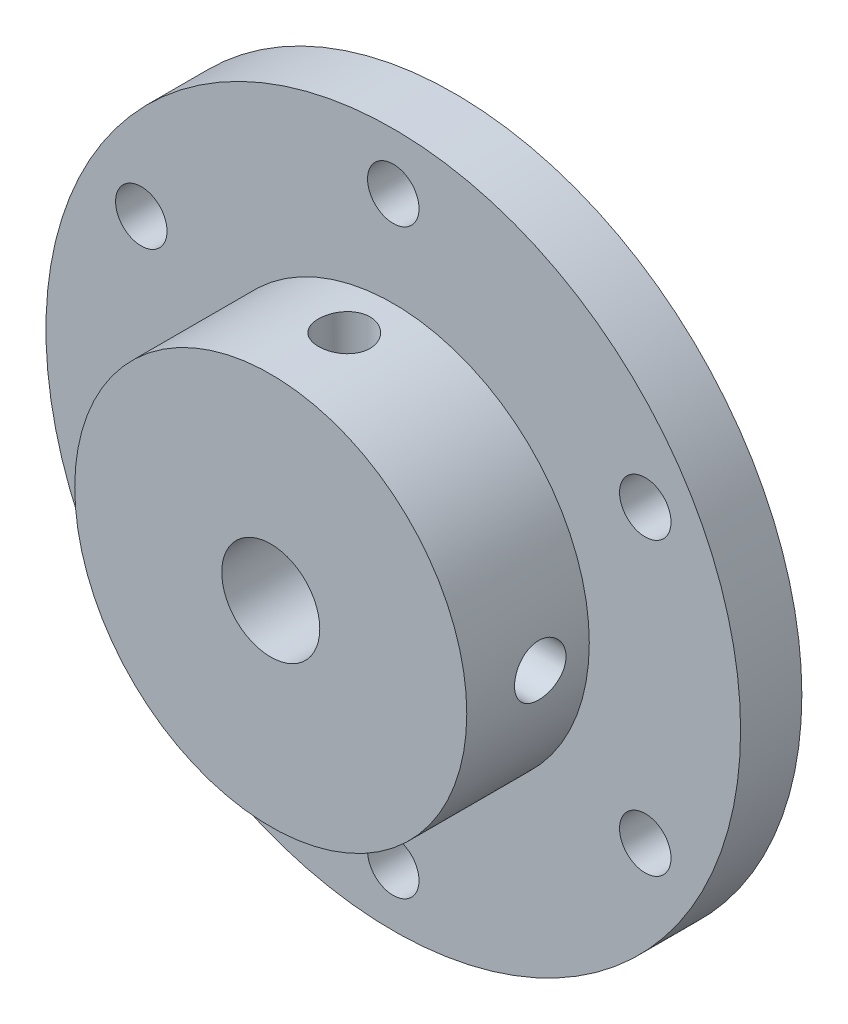
ISO-10303-21;
HEADER;
FILE_DESCRIPTION(('STEP AP214'),'2;1');
FILE_NAME('part.step','',(''),(''),'','','');
FILE_SCHEMA(('AUTOMOTIVE_DESIGN { 1 0 10303 214 1 1 1 1 }'));
ENDSEC;
DATA;
#1=APPLICATION_CONTEXT('core data for automotive mechanical design processes');
#2=APPLICATION_PROTOCOL_DEFINITION('international standard','automotive_design',2000,#1);
#3=PRODUCT_CONTEXT('',#1,'mechanical');
#4=PRODUCT('Part','Part','',(#3));
#5=PRODUCT_RELATED_PRODUCT_CATEGORY('part','',(#4));
#6=PRODUCT_DEFINITION_FORMATION('','',#4);
#7=PRODUCT_DEFINITION_CONTEXT('part definition',#1,'design');
#8=PRODUCT_DEFINITION('design','',#6,#7);
#9=PRODUCT_DEFINITION_SHAPE('','',#8);
#10=(LENGTH_UNIT() NAMED_UNIT(*) SI_UNIT(.MILLI.,.METRE.));
#11=(NAMED_UNIT(*) PLANE_ANGLE_UNIT() SI_UNIT($,.RADIAN.));
#12=(NAMED_UNIT(*) SI_UNIT($,.STERADIAN.) SOLID_ANGLE_UNIT());
#13=UNCERTAINTY_MEASURE_WITH_UNIT(LENGTH_MEASURE(1.E-05),#10,'distance_accuracy_value','');
#14=(GEOMETRIC_REPRESENTATION_CONTEXT(3) GLOBAL_UNCERTAINTY_ASSIGNED_CONTEXT((#13)) GLOBAL_UNIT_ASSIGNED_CONTEXT((#10,
#11,#12)) REPRESENTATION_CONTEXT('',''));
#15=CARTESIAN_POINT('',(0.,0.,0.));
#16=DIRECTION('',(0.,0.,1.));
#17=DIRECTION('',(1.,0.,0.));
#18=AXIS2_PLACEMENT_3D('',#15,#16,#17);
#19=CARTESIAN_POINT('',(0.,0.,5.));
#20=DIRECTION('',(0.,0.,-1.));
#21=DIRECTION('',(-1.,0.,0.));
#22=AXIS2_PLACEMENT_3D('',#19,#20,#21);
#23=CYLINDRICAL_SURFACE('',#22,28.35);
#24=CARTESIAN_POINT('',(0.,0.,5.));
#25=DIRECTION('',(0.,0.,1.));
#26=DIRECTION('',(1.,0.,0.));
#27=AXIS2_PLACEMENT_3D('',#24,#25,#26);
#28=CIRCLE('',#27,28.35);
#29=CARTESIAN_POINT('',(28.35,0.,5.));
#30=VERTEX_POINT('',#29);
#31=EDGE_CURVE('E10',#30,#30,#28,.T.);
#32=ORIENTED_EDGE('',*,*,#31,.F.);
#33=EDGE_LOOP('',(#32));
#34=FACE_BOUND('',#33,.T.);
#35=CARTESIAN_POINT('',(0.,0.,0.));
#36=DIRECTION('',(0.,0.,1.));
#37=DIRECTION('',(1.,0.,0.));
#38=AXIS2_PLACEMENT_3D('',#35,#36,#37);
#39=CIRCLE('',#38,28.35);
#40=CARTESIAN_POINT('',(28.35,0.,0.));
#41=VERTEX_POINT('',#40);
#42=EDGE_CURVE('E44',#41,#41,#39,.T.);
#43=ORIENTED_EDGE('',*,*,#42,.T.);
#44=EDGE_LOOP('',(#43));
#45=FACE_BOUND('',#44,.T.);
#46=ADVANCED_FACE('F41',(#34,#45),#23,.T.);
#47=CARTESIAN_POINT('',(0.,0.,5.));
#48=DIRECTION('',(0.,0.,1.));
#49=DIRECTION('',(1.,0.,0.));
#50=AXIS2_PLACEMENT_3D('',#47,#48,#49);
#51=PLANE('',#50);
#52=CARTESIAN_POINT('',(-20.5681033398803,11.8750000000002,5.));
#53=DIRECTION('',(0.,0.,1.));
#54=DIRECTION('',(1.,0.,0.));
#55=AXIS2_PLACEMENT_3D('',#52,#53,#54);
#56=CIRCLE('',#55,2.09999999999999);
#57=CARTESIAN_POINT('',(-18.4681033398803,11.8750000000002,5.));
#58=VERTEX_POINT('',#57);
#59=EDGE_CURVE('E115',#58,#58,#56,.T.);
#60=ORIENTED_EDGE('',*,*,#59,.F.);
#61=EDGE_LOOP('',(#60));
#62=FACE_BOUND('',#61,.T.);
#63=CARTESIAN_POINT('',(-20.5681033398805,-11.8749999999998,5.));
#64=DIRECTION('',(0.,0.,1.));
#65=DIRECTION('',(1.,0.,0.));
#66=AXIS2_PLACEMENT_3D('',#63,#64,#65);
#67=CIRCLE('',#66,2.09999999999999);
#68=CARTESIAN_POINT('',(-18.4681033398805,-11.8749999999998,5.));
#69=VERTEX_POINT('',#68);
#70=EDGE_CURVE('E107',#69,#69,#67,.T.);
#71=ORIENTED_EDGE('',*,*,#70,.F.);
#72=EDGE_LOOP('',(#71));
#73=FACE_BOUND('',#72,.T.);
#74=CARTESIAN_POINT('',(0.,-23.75,5.));
#75=DIRECTION('',(0.,0.,1.));
#76=DIRECTION('',(1.,0.,0.));
#77=AXIS2_PLACEMENT_3D('',#74,#75,#76);
#78=CIRCLE('',#77,2.09999999999999);
#79=CARTESIAN_POINT('',(2.09999999999999,-23.75,5.));
#80=VERTEX_POINT('',#79);
#81=EDGE_CURVE('E99',#80,#80,#78,.T.);
#82=ORIENTED_EDGE('',*,*,#81,.F.);
#83=EDGE_LOOP('',(#82));
#84=FACE_BOUND('',#83,.T.);
#85=CARTESIAN_POINT('',(20.5681033398804,-11.8750000000001,5.));
#86=DIRECTION('',(0.,0.,1.));
#87=DIRECTION('',(1.,0.,0.));
#88=AXIS2_PLACEMENT_3D('',#85,#86,#87);
#89=CIRCLE('',#88,2.09999999999999);
#90=CARTESIAN_POINT('',(22.6681033398804,-11.8750000000001,5.));
#91=VERTEX_POINT('',#90);
#92=EDGE_CURVE('E92',#91,#91,#89,.T.);
#93=ORIENTED_EDGE('',*,*,#92,.F.);
#94=EDGE_LOOP('',(#93));
#95=FACE_BOUND('',#94,.T.);
#96=CARTESIAN_POINT('',(20.5681033398804,11.875,5.));
#97=DIRECTION('',(0.,0.,1.));
#98=DIRECTION('',(1.,0.,0.));
#99=AXIS2_PLACEMENT_3D('',#96,#97,#98);
#100=CIRCLE('',#99,2.09999999999999);
#101=CARTESIAN_POINT('',(22.6681033398804,11.875,5.));
#102=VERTEX_POINT('',#101);
#103=EDGE_CURVE('E84',#102,#102,#100,.T.);
#104=ORIENTED_EDGE('',*,*,#103,.F.);
#105=EDGE_LOOP('',(#104));
#106=FACE_BOUND('',#105,.T.);
#107=CARTESIAN_POINT('',(0.,23.75,5.));
#108=DIRECTION('',(0.,0.,1.));
#109=DIRECTION('',(1.,0.,0.));
#110=AXIS2_PLACEMENT_3D('',#107,#108,#109);
#111=CIRCLE('',#110,2.09999999999999);
#112=CARTESIAN_POINT('',(2.09999999999999,23.75,5.));
#113=VERTEX_POINT('',#112);
#114=EDGE_CURVE('E76',#113,#113,#111,.T.);
#115=ORIENTED_EDGE('',*,*,#114,.F.);
#116=EDGE_LOOP('',(#115));
#117=FACE_BOUND('',#116,.T.);
#118=CARTESIAN_POINT('',(0.,0.,5.));
#119=DIRECTION('',(0.,0.,1.));
#120=DIRECTION('',(1.,0.,0.));
#121=AXIS2_PLACEMENT_3D('',#118,#119,#120);
#122=CIRCLE('',#121,16.);
#123=CARTESIAN_POINT('',(16.,0.,5.));
#124=VERTEX_POINT('',#123);
#125=EDGE_CURVE('E57',#124,#124,#122,.T.);
#126=ORIENTED_EDGE('',*,*,#125,.F.);
#127=EDGE_LOOP('',(#126));
#128=FACE_BOUND('',#127,.T.);
#129=ORIENTED_EDGE('',*,*,#31,.T.);
#130=EDGE_LOOP('',(#129));
#131=FACE_BOUND('',#130,.T.);
#132=ADVANCED_FACE('F178',(#62,#73,#84,#95,#106,#117,#128,#131),#51,.T.);
#133=CARTESIAN_POINT('',(0.,0.,0.));
#134=DIRECTION('',(0.,0.,1.));
#135=DIRECTION('',(1.,0.,0.));
#136=AXIS2_PLACEMENT_3D('',#133,#134,#135);
#137=PLANE('',#136);
#138=CARTESIAN_POINT('',(-20.5681033398803,11.8750000000002,0.));
#139=DIRECTION('',(0.,0.,1.));
#140=DIRECTION('',(1.,0.,0.));
#141=AXIS2_PLACEMENT_3D('',#138,#139,#140);
#142=CIRCLE('',#141,2.1);
#143=CARTESIAN_POINT('',(-18.4681033398803,11.8750000000002,0.));
#144=VERTEX_POINT('',#143);
#145=EDGE_CURVE('E111',#144,#144,#142,.T.);
#146=ORIENTED_EDGE('',*,*,#145,.T.);
#147=EDGE_LOOP('',(#146));
#148=FACE_BOUND('',#147,.T.);
#149=CARTESIAN_POINT('',(-20.5681033398805,-11.8749999999998,0.));
#150=DIRECTION('',(0.,0.,1.));
#151=DIRECTION('',(1.,0.,0.));
#152=AXIS2_PLACEMENT_3D('',#149,#150,#151);
#153=CIRCLE('',#152,2.1);
#154=CARTESIAN_POINT('',(-18.4681033398805,-11.8749999999998,0.));
#155=VERTEX_POINT('',#154);
#156=EDGE_CURVE('E103',#155,#155,#153,.T.);
#157=ORIENTED_EDGE('',*,*,#156,.T.);
#158=EDGE_LOOP('',(#157));
#159=FACE_BOUND('',#158,.T.);
#160=CARTESIAN_POINT('',(0.,-23.75,0.));
#161=DIRECTION('',(0.,0.,1.));
#162=DIRECTION('',(1.,0.,0.));
#163=AXIS2_PLACEMENT_3D('',#160,#161,#162);
#164=CIRCLE('',#163,2.1);
#165=CARTESIAN_POINT('',(2.1,-23.75,0.));
#166=VERTEX_POINT('',#165);
#167=EDGE_CURVE('E95',#166,#166,#164,.T.);
#168=ORIENTED_EDGE('',*,*,#167,.T.);
#169=EDGE_LOOP('',(#168));
#170=FACE_BOUND('',#169,.T.);
#171=CARTESIAN_POINT('',(20.5681033398804,-11.8750000000001,0.));
#172=DIRECTION('',(0.,0.,1.));
#173=DIRECTION('',(1.,0.,0.));
#174=AXIS2_PLACEMENT_3D('',#171,#172,#173);
#175=CIRCLE('',#174,2.1);
#176=CARTESIAN_POINT('',(22.6681033398804,-11.8750000000001,0.));
#177=VERTEX_POINT('',#176);
#178=EDGE_CURVE('E88',#177,#177,#175,.T.);
#179=ORIENTED_EDGE('',*,*,#178,.T.);
#180=EDGE_LOOP('',(#179));
#181=FACE_BOUND('',#180,.T.);
#182=CARTESIAN_POINT('',(20.5681033398804,11.875,0.));
#183=DIRECTION('',(0.,0.,1.));
#184=DIRECTION('',(1.,0.,0.));
#185=AXIS2_PLACEMENT_3D('',#182,#183,#184);
#186=CIRCLE('',#185,2.1);
#187=CARTESIAN_POINT('',(22.6681033398804,11.875,0.));
#188=VERTEX_POINT('',#187);
#189=EDGE_CURVE('E80',#188,#188,#186,.T.);
#190=ORIENTED_EDGE('',*,*,#189,.T.);
#191=EDGE_LOOP('',(#190));
#192=FACE_BOUND('',#191,.T.);
#193=CARTESIAN_POINT('',(0.,23.75,0.));
#194=DIRECTION('',(0.,0.,1.));
#195=DIRECTION('',(1.,0.,0.));
#196=AXIS2_PLACEMENT_3D('',#193,#194,#195);
#197=CIRCLE('',#196,2.1);
#198=CARTESIAN_POINT('',(2.1,23.75,0.));
#199=VERTEX_POINT('',#198);
#200=EDGE_CURVE('E69',#199,#199,#197,.T.);
#201=ORIENTED_EDGE('',*,*,#200,.T.);
#202=EDGE_LOOP('',(#201));
#203=FACE_BOUND('',#202,.T.);
#204=CARTESIAN_POINT('',(0.,0.,0.));
#205=DIRECTION('',(0.,0.,1.));
#206=DIRECTION('',(1.,0.,0.));
#207=AXIS2_PLACEMENT_3D('',#204,#205,#206);
#208=CIRCLE('',#207,4.);
#209=CARTESIAN_POINT('',(4.,0.,0.));
#210=VERTEX_POINT('',#209);
#211=EDGE_CURVE('E61',#210,#210,#208,.T.);
#212=ORIENTED_EDGE('',*,*,#211,.T.);
#213=EDGE_LOOP('',(#212));
#214=FACE_BOUND('',#213,.T.);
#215=ORIENTED_EDGE('',*,*,#42,.F.);
#216=EDGE_LOOP('',(#215));
#217=FACE_BOUND('',#216,.T.);
#218=ADVANCED_FACE('F183',(#148,#159,#170,#181,#192,#203,#214,#217),#137,.F.);
#219=CARTESIAN_POINT('',(0.,0.,15.));
#220=DIRECTION('',(0.,0.,-1.));
#221=DIRECTION('',(-1.,0.,0.));
#222=AXIS2_PLACEMENT_3D('',#219,#220,#221);
#223=CYLINDRICAL_SURFACE('',#222,16.);
#224=CARTESIAN_POINT('',(0.,16.,6.9));
#225=CARTESIAN_POINT('',(0.117416484353101,15.9999982962631,6.90000495705236));
#226=CARTESIAN_POINT('',(0.234905122011886,15.9986938773925,6.90988080691643));
#227=CARTESIAN_POINT('',(0.46660966558349,15.9936157778764,6.94911967052718));
#228=CARTESIAN_POINT('',(0.580822081998047,15.9898395595276,6.97850271201433));
#229=CARTESIAN_POINT('',(0.802586512568985,15.9802430281394,7.05587240992261));
#230=CARTESIAN_POINT('',(0.910143079615392,15.9744241309754,7.10384618263218));
#231=CARTESIAN_POINT('',(1.1156593399402,15.9613884397463,7.21700655797674));
#232=CARTESIAN_POINT('',(1.21362060219516,15.9541718747973,7.28219034005323));
#233=CARTESIAN_POINT('',(1.39777717587374,15.9390970395828,7.4283413083698));
#234=CARTESIAN_POINT('',(1.48390610575507,15.9312355150333,7.50939181113075));
#235=CARTESIAN_POINT('',(1.64138117851605,15.9157828604001,7.68479647193949));
#236=CARTESIAN_POINT('',(1.71272654645484,15.908191744508,7.77915132695387));
#237=CARTESIAN_POINT('',(1.83885928171324,15.8941075163014,7.9789213126258));
#238=CARTESIAN_POINT('',(1.89358395666576,15.8876186009931,8.08437634803382));
#239=CARTESIAN_POINT('',(1.98452144739534,15.8765168113299,8.30307955175785));
#240=CARTESIAN_POINT('',(2.02073503589053,15.8719038586674,8.41632739455061));
#241=CARTESIAN_POINT('',(2.0734195616491,15.8651076274545,8.64671017399985));
#242=CARTESIAN_POINT('',(2.0900029894288,15.8629105101852,8.76381897060127));
#243=CARTESIAN_POINT('',(2.10330463008907,15.8611524584727,8.9991763708029));
#244=CARTESIAN_POINT('',(2.10002372107694,15.8615914075016,9.11742492378924));
#245=CARTESIAN_POINT('',(2.07378206445453,15.8650432287045,9.35091875534377));
#246=CARTESIAN_POINT('',(2.05094554741099,15.86803985239,9.46617827025772));
#247=CARTESIAN_POINT('',(1.98643489899057,15.8762440291591,9.69121497797564));
#248=CARTESIAN_POINT('',(1.94476035031288,15.8814516312202,9.80099204927247));
#249=CARTESIAN_POINT('',(1.84362411100889,15.8935093147413,10.0123317781193));
#250=CARTESIAN_POINT('',(1.78410875473803,15.9003643391794,10.1138684605443));
#251=CARTESIAN_POINT('',(1.64901867206016,15.9149407211294,10.3055604124572));
#252=CARTESIAN_POINT('',(1.57344313629226,15.9226621222936,10.395715107979));
#253=CARTESIAN_POINT('',(1.40769104741128,15.9381733835384,10.5628047526722));
#254=CARTESIAN_POINT('',(1.31740747591083,15.9459633163989,10.6396335731953));
#255=CARTESIAN_POINT('',(1.12516973659486,15.9606788849759,10.7770631591691));
#256=CARTESIAN_POINT('',(1.02321553695396,15.9676045183355,10.8376638803649));
#257=CARTESIAN_POINT('',(0.810446436820828,15.9798160936183,10.9409183626588));
#258=CARTESIAN_POINT('',(0.699628098002014,15.9851013953531,10.9835651189946));
#259=CARTESIAN_POINT('',(0.472318289200564,15.9934311173904,11.0496149743927));
#260=CARTESIAN_POINT('',(0.355827112547463,15.9964756534268,11.0730190673325));
#261=CARTESIAN_POINT('',(0.121395629387381,15.9999656992249,11.0997808566156));
#262=CARTESIAN_POINT('',(0.00347227541262585,16.0004301540478,11.103284681241));
#263=CARTESIAN_POINT('',(-0.231280014343775,15.9987589549612,11.0905326292899));
#264=CARTESIAN_POINT('',(-0.348108975814987,15.9966233622396,11.0742772177153));
#265=CARTESIAN_POINT('',(-0.576922284105939,15.990003800972,11.0225895536893));
#266=CARTESIAN_POINT('',(-0.688922719796446,15.9855284102365,10.9872273319612));
#267=CARTESIAN_POINT('',(-0.905403997412974,15.974730073111,10.8984029024912));
#268=CARTESIAN_POINT('',(-1.00988456025589,15.9684070581947,10.8449400234038));
#269=CARTESIAN_POINT('',(-1.2090105555854,15.9545706371482,10.721080854769));
#270=CARTESIAN_POINT('',(-1.30359699513709,15.947050698098,10.6505904659569));
#271=CARTESIAN_POINT('',(-1.47964872574463,15.9316811346644,10.4948098674338));
#272=CARTESIAN_POINT('',(-1.56111344006267,15.9238314958089,10.4095190075414));
#273=CARTESIAN_POINT('',(-1.70913080865221,15.9086283992346,10.2259132317372));
#274=CARTESIAN_POINT('',(-1.77558633636806,15.9012783770394,10.1275196890213));
#275=CARTESIAN_POINT('',(-1.89102695628024,15.8879642527691,9.9208813855286));
#276=CARTESIAN_POINT('',(-1.94001242853152,15.8820001205453,9.81263683912125));
#277=CARTESIAN_POINT('',(-2.01896672841902,15.8721568354206,9.58967701758747));
#278=CARTESIAN_POINT('',(-2.04898946191644,15.8682717771357,9.47498110347114));
#279=CARTESIAN_POINT('',(-2.08933920892608,15.8630098837321,9.24212126875103));
#280=CARTESIAN_POINT('',(-2.09966724065018,15.8616329189455,9.12395752775389));
#281=CARTESIAN_POINT('',(-2.10031443069061,15.8615471546198,8.88848292944531));
#282=CARTESIAN_POINT('',(-2.09078619999575,15.8628180045269,8.77117246991539));
#283=CARTESIAN_POINT('',(-2.05231540968838,15.8678408142836,8.53983620079543));
#284=CARTESIAN_POINT('',(-2.02337285486407,15.8715927735212,8.4258103903953));
#285=CARTESIAN_POINT('',(-1.94694420408523,15.8811485642185,8.20430550752034));
#286=CARTESIAN_POINT('',(-1.89946624400469,15.8869514953252,8.09682358658503));
#287=CARTESIAN_POINT('',(-1.78732950445978,15.8999567709492,7.89132723687448));
#288=CARTESIAN_POINT('',(-1.7226704229297,15.9071591400699,7.79331297459389));
#289=CARTESIAN_POINT('',(-1.57744326503153,15.9222180092564,7.60875508025564));
#290=CARTESIAN_POINT('',(-1.49676157774286,15.9300789344295,7.52230120152492));
#291=CARTESIAN_POINT('',(-1.32201773458277,15.9455305998353,7.36410229468749));
#292=CARTESIAN_POINT('',(-1.22795244033518,15.9531212761728,7.29236072619036));
#293=CARTESIAN_POINT('',(-1.02865642383035,15.9672126278133,7.16536363306548));
#294=CARTESIAN_POINT('',(-0.92338060789378,15.9737086069784,7.1101783818222));
#295=CARTESIAN_POINT('',(-0.705026961411324,15.9848315489309,7.01835047192648));
#296=CARTESIAN_POINT('',(-0.591957665878867,15.9894605194548,6.98168788366503));
#297=CARTESIAN_POINT('',(-0.398600577498265,15.9952257223333,6.93661582244385));
#298=CARTESIAN_POINT('',(-0.319526543474694,15.9970072452264,6.92290490974843));
#299=CARTESIAN_POINT('',(-0.160312880332424,15.9993949607654,6.90459534461191));
#300=CARTESIAN_POINT('',(-0.0801732602122652,16.0000011633302,6.89999661527041));
#301=CARTESIAN_POINT('',(0.,16.,6.9));
#302=B_SPLINE_CURVE_WITH_KNOTS('',3,(#224,#225,#226,#227,#228,#229,#230,#231,#232,#233,#234,
#235,#236,#237,#238,#239,#240,#241,#242,#243,#244,#245,#246,#247,#248,#249,#250,#251,#252,#253,
#254,#255,#256,#257,#258,#259,#260,#261,#262,#263,#264,#265,#266,#267,#268,#269,#270,#271,#272,
#273,#274,#275,#276,#277,#278,#279,#280,#281,#282,#283,#284,#285,#286,#287,#288,#289,#290,#291,
#292,#293,#294,#295,#296,#297,#298,#299,#300,#301),.UNSPECIFIED.,.T.,.F.,(4,2,2,2,2,2,2,2,2,2,2,
2,2,2,2,2,2,2,2,2,2,2,2,2,2,2,2,2,2,2,2,2,2,2,2,2,2,2,4),(0.,0.351956579597511,
0.704275067694986,1.05634982812868,1.40836692260357,1.76228460352201,2.11622083179281,
2.47147596652803,2.82671627044792,3.17991086217002,3.53308984096311,3.88404169036012,
4.23500131443719,4.58702741286474,4.93907125603529,5.29380151830566,5.64853274793558,
6.00340224843456,6.3582534188827,6.71049550361345,7.06272929905445,7.41368075090289,
7.76464522081313,8.11759548065945,8.47056124946068,8.82574953425381,9.18093009157841,
9.53509636913479,9.88924433587378,10.2406804386662,10.5921164547833,10.9433983857755,
11.2946864931543,11.6485606276522,12.0025178807117,12.3579569170413,12.7130126970204,
12.9533345286082,13.1936543320409),.UNSPECIFIED.);
#303=CARTESIAN_POINT('',(0.,16.,6.9));
#304=VERTEX_POINT('',#303);
#305=EDGE_CURVE('E324',#304,#304,#302,.T.);
#306=ORIENTED_EDGE('',*,*,#305,.T.);
#307=EDGE_LOOP('',(#306));
#308=FACE_BOUND('',#307,.T.);
#309=CARTESIAN_POINT('',(16.,0.,11.1));
#310=CARTESIAN_POINT('',(15.9999982962631,0.117416484353101,11.0999950429476));
#311=CARTESIAN_POINT('',(15.9986938773925,0.234905122011886,11.0901191930836));
#312=CARTESIAN_POINT('',(15.9936157778764,0.46660966558349,11.0508803294728));
#313=CARTESIAN_POINT('',(15.9898395595276,0.580822081998047,11.0214972879857));
#314=CARTESIAN_POINT('',(15.9802430281394,0.802586512568985,10.9441275900774));
#315=CARTESIAN_POINT('',(15.9744241309754,0.910143079615392,10.8961538173678));
#316=CARTESIAN_POINT('',(15.9613884397463,1.1156593399402,10.7829934420233));
#317=CARTESIAN_POINT('',(15.9541718747973,1.21362060219516,10.7178096599468));
#318=CARTESIAN_POINT('',(15.9390970395828,1.39777717587374,10.5716586916302));
#319=CARTESIAN_POINT('',(15.9312355150333,1.48390610575507,10.4906081888693));
#320=CARTESIAN_POINT('',(15.9157828604001,1.64138117851605,10.3152035280605));
#321=CARTESIAN_POINT('',(15.908191744508,1.71272654645484,10.2208486730461));
#322=CARTESIAN_POINT('',(15.8941075163014,1.83885928171324,10.0210786873742));
#323=CARTESIAN_POINT('',(15.8876186009931,1.89358395666576,9.91562365196618));
#324=CARTESIAN_POINT('',(15.8765168113299,1.98452144739534,9.69692044824215));
#325=CARTESIAN_POINT('',(15.8719038586674,2.02073503589053,9.58367260544939));
#326=CARTESIAN_POINT('',(15.8651076274545,2.0734195616491,9.35328982600015));
#327=CARTESIAN_POINT('',(15.8629105101852,2.0900029894288,9.23618102939873));
#328=CARTESIAN_POINT('',(15.8611524584727,2.10330463008907,9.0008236291971));
#329=CARTESIAN_POINT('',(15.8615914075016,2.10002372107694,8.88257507621077));
#330=CARTESIAN_POINT('',(15.8650432287045,2.07378206445453,8.64908124465623));
#331=CARTESIAN_POINT('',(15.86803985239,2.05094554741099,8.53382172974228));
#332=CARTESIAN_POINT('',(15.8762440291591,1.98643489899057,8.30878502202437));
#333=CARTESIAN_POINT('',(15.8814516312202,1.94476035031288,8.19900795072753));
#334=CARTESIAN_POINT('',(15.8935093147413,1.84362411100889,7.98766822188072));
#335=CARTESIAN_POINT('',(15.9003643391794,1.78410875473803,7.88613153945571));
#336=CARTESIAN_POINT('',(15.9149407211294,1.64901867206016,7.69443958754275));
#337=CARTESIAN_POINT('',(15.9226621222936,1.57344313629226,7.60428489202098));
#338=CARTESIAN_POINT('',(15.9381733835384,1.40769104741128,7.43719524732779));
#339=CARTESIAN_POINT('',(15.9459633163989,1.31740747591083,7.36036642680472));
#340=CARTESIAN_POINT('',(15.9606788849759,1.12516973659486,7.22293684083089));
#341=CARTESIAN_POINT('',(15.9676045183355,1.02321553695397,7.16233611963506));
#342=CARTESIAN_POINT('',(15.9798160936183,0.81044643682083,7.05908163734115));
#343=CARTESIAN_POINT('',(15.9851013953531,0.699628098002016,7.01643488100538));
#344=CARTESIAN_POINT('',(15.9934311173904,0.472318289200565,6.95038502560732));
#345=CARTESIAN_POINT('',(15.9964756534268,0.355827112547464,6.92698093266746));
#346=CARTESIAN_POINT('',(15.9999656992249,0.121395629387381,6.90021914338435));
#347=CARTESIAN_POINT('',(16.0004301540478,0.00347227541262604,6.89671531875902));
#348=CARTESIAN_POINT('',(15.9987589549612,-0.231280014343775,6.90946737071011));
#349=CARTESIAN_POINT('',(15.9966233622396,-0.348108975814986,6.92572278228472));
#350=CARTESIAN_POINT('',(15.990003800972,-0.576922284105938,6.97741044631073));
#351=CARTESIAN_POINT('',(15.9855284102365,-0.688922719796446,7.01277266803877));
#352=CARTESIAN_POINT('',(15.974730073111,-0.905403997412974,7.10159709750879));
#353=CARTESIAN_POINT('',(15.9684070581947,-1.00988456025589,7.15505997659622));
#354=CARTESIAN_POINT('',(15.9545706371482,-1.2090105555854,7.27891914523096));
#355=CARTESIAN_POINT('',(15.947050698098,-1.30359699513709,7.34940953404312));
#356=CARTESIAN_POINT('',(15.9316811346644,-1.47964872574463,7.50519013256623));
#357=CARTESIAN_POINT('',(15.9238314958089,-1.56111344006267,7.59048099245864));
#358=CARTESIAN_POINT('',(15.9086283992346,-1.70913080865221,7.77408676826283));
#359=CARTESIAN_POINT('',(15.9012783770394,-1.77558633636806,7.87248031097871));
#360=CARTESIAN_POINT('',(15.8879642527691,-1.89102695628024,8.0791186144714));
#361=CARTESIAN_POINT('',(15.8820001205454,-1.94001242853152,8.18736316087875));
#362=CARTESIAN_POINT('',(15.8721568354206,-2.01896672841902,8.41032298241254));
#363=CARTESIAN_POINT('',(15.8682717771357,-2.04898946191644,8.52501889652886));
#364=CARTESIAN_POINT('',(15.8630098837321,-2.08933920892608,8.75787873124897));
#365=CARTESIAN_POINT('',(15.8616329189455,-2.09966724065018,8.87604247224611));
#366=CARTESIAN_POINT('',(15.8615471546198,-2.10031443069061,9.11151707055469));
#367=CARTESIAN_POINT('',(15.8628180045269,-2.09078619999575,9.22882753008461));
#368=CARTESIAN_POINT('',(15.8678408142836,-2.05231540968838,9.46016379920457));
#369=CARTESIAN_POINT('',(15.8715927735212,-2.02337285486407,9.5741896096047));
#370=CARTESIAN_POINT('',(15.8811485642185,-1.94694420408523,9.79569449247966));
#371=CARTESIAN_POINT('',(15.8869514953252,-1.89946624400469,9.90317641341496));
#372=CARTESIAN_POINT('',(15.8999567709492,-1.78732950445978,10.1086727631255));
#373=CARTESIAN_POINT('',(15.9071591400699,-1.7226704229297,10.2066870254061));
#374=CARTESIAN_POINT('',(15.9222180092564,-1.57744326503153,10.3912449197444));
#375=CARTESIAN_POINT('',(15.9300789344295,-1.49676157774286,10.4776987984751));
#376=CARTESIAN_POINT('',(15.9455305998353,-1.32201773458277,10.6358977053125));
#377=CARTESIAN_POINT('',(15.9531212761728,-1.22795244033518,10.7076392738096));
#378=CARTESIAN_POINT('',(15.9672126278133,-1.02865642383035,10.8346363669345));
#379=CARTESIAN_POINT('',(15.9737086069784,-0.923380607893781,10.8898216181778));
#380=CARTESIAN_POINT('',(15.9848315489309,-0.705026961411324,10.9816495280735));
#381=CARTESIAN_POINT('',(15.9894605194548,-0.591957665878868,11.018312116335));
#382=CARTESIAN_POINT('',(15.9952257223333,-0.398600577498267,11.0633841775562));
#383=CARTESIAN_POINT('',(15.9970072452264,-0.319526543474696,11.0770950902516));
#384=CARTESIAN_POINT('',(15.9993949607654,-0.160312880332425,11.0954046553881));
#385=CARTESIAN_POINT('',(16.0000011633302,-0.0801732602122659,11.1000033847296));
#386=CARTESIAN_POINT('',(16.,0.,11.1));
#387=B_SPLINE_CURVE_WITH_KNOTS('',3,(#309,#310,#311,#312,#313,#314,#315,#316,#317,#318,#319,
#320,#321,#322,#323,#324,#325,#326,#327,#328,#329,#330,#331,#332,#333,#334,#335,#336,#337,#338,
#339,#340,#341,#342,#343,#344,#345,#346,#347,#348,#349,#350,#351,#352,#353,#354,#355,#356,#357,
#358,#359,#360,#361,#362,#363,#364,#365,#366,#367,#368,#369,#370,#371,#372,#373,#374,#375,#376,
#377,#378,#379,#380,#381,#382,#383,#384,#385,#386),.UNSPECIFIED.,.T.,.F.,(4,2,2,2,2,2,2,2,2,2,2,
2,2,2,2,2,2,2,2,2,2,2,2,2,2,2,2,2,2,2,2,2,2,2,2,2,2,2,4),(0.,0.351956579597511,
0.704275067694986,1.05634982812868,1.40836692260357,1.76228460352201,2.11622083179281,
2.47147596652803,2.82671627044793,3.17991086217002,3.53308984096311,3.88404169036011,
4.23500131443719,4.58702741286474,4.93907125603529,5.29380151830566,5.64853274793558,
6.00340224843456,6.3582534188827,6.71049550361345,7.06272929905445,7.41368075090289,
7.76464522081313,8.11759548065946,8.47056124946068,8.82574953425381,9.18093009157841,
9.53509636913479,9.88924433587378,10.2406804386662,10.5921164547833,10.9433983857755,
11.2946864931543,11.6485606276522,12.0025178807117,12.3579569170413,12.7130126970204,
12.9533345286082,13.1936543320409),.UNSPECIFIED.);
#388=CARTESIAN_POINT('',(16.,0.,11.1));
#389=VERTEX_POINT('',#388);
#390=EDGE_CURVE('E127',#389,#389,#387,.T.);
#391=ORIENTED_EDGE('',*,*,#390,.T.);
#392=EDGE_LOOP('',(#391));
#393=FACE_BOUND('',#392,.T.);
#394=CARTESIAN_POINT('',(0.,0.,15.));
#395=DIRECTION('',(0.,0.,1.));
#396=DIRECTION('',(1.,0.,0.));
#397=AXIS2_PLACEMENT_3D('',#394,#395,#396);
#398=CIRCLE('',#397,16.);
#399=CARTESIAN_POINT('',(16.,0.,15.));
#400=VERTEX_POINT('',#399);
#401=EDGE_CURVE('E55',#400,#400,#398,.T.);
#402=ORIENTED_EDGE('',*,*,#401,.F.);
#403=EDGE_LOOP('',(#402));
#404=FACE_BOUND('',#403,.T.);
#405=ORIENTED_EDGE('',*,*,#125,.T.);
#406=EDGE_LOOP('',(#405));
#407=FACE_BOUND('',#406,.T.);
#408=ADVANCED_FACE('F190',(#308,#393,#404,#407),#223,.T.);
#409=CARTESIAN_POINT('',(0.,0.,15.));
#410=DIRECTION('',(0.,0.,1.));
#411=DIRECTION('',(1.,0.,0.));
#412=AXIS2_PLACEMENT_3D('',#409,#410,#411);
#413=PLANE('',#412);
#414=CARTESIAN_POINT('',(0.,0.,15.));
#415=DIRECTION('',(0.,0.,1.));
#416=DIRECTION('',(1.,0.,0.));
#417=AXIS2_PLACEMENT_3D('',#414,#415,#416);
#418=CIRCLE('',#417,4.);
#419=CARTESIAN_POINT('',(4.,0.,15.));
#420=VERTEX_POINT('',#419);
#421=EDGE_CURVE('E65',#420,#420,#418,.T.);
#422=ORIENTED_EDGE('',*,*,#421,.F.);
#423=EDGE_LOOP('',(#422));
#424=FACE_BOUND('',#423,.T.);
#425=ORIENTED_EDGE('',*,*,#401,.T.);
#426=EDGE_LOOP('',(#425));
#427=FACE_BOUND('',#426,.T.);
#428=ADVANCED_FACE('F173',(#424,#427),#413,.T.);
#429=CARTESIAN_POINT('',(0.,0.,0.));
#430=DIRECTION('',(0.,0.,1.));
#431=DIRECTION('',(1.,0.,0.));
#432=AXIS2_PLACEMENT_3D('',#429,#430,#431);
#433=CYLINDRICAL_SURFACE('',#432,4.);
#434=CARTESIAN_POINT('',(0.,4.,6.9));
#435=CARTESIAN_POINT('',(-0.109725239522176,3.99999264287857,6.90000850817598));
#436=CARTESIAN_POINT('',(-0.219566121797986,3.99543735627817,6.90865077782147));
#437=CARTESIAN_POINT('',(-0.435956332853303,3.97766056559727,6.94282051483628));
#438=CARTESIAN_POINT('',(-0.54249996702617,3.96442485872988,6.96837565544408));
#439=CARTESIAN_POINT('',(-0.748847767256637,3.93066356262107,7.03507317958002));
#440=CARTESIAN_POINT('',(-0.84867708849202,3.91016722161181,7.07615306803517));
#441=CARTESIAN_POINT('',(-1.0398542926017,3.86372814833453,7.17238731973));
#442=CARTESIAN_POINT('',(-1.13120230734359,3.83778550076629,7.22754146409275));
#443=CARTESIAN_POINT('',(-1.30947182891695,3.78081963010103,7.35439519620999));
#444=CARTESIAN_POINT('',(-1.39572427915895,3.7495762633363,7.42693455056421));
#445=CARTESIAN_POINT('',(-1.55546505007128,3.68618069665244,7.58467431609372));
#446=CARTESIAN_POINT('',(-1.62894256542358,3.65402775386038,7.66988533331476));
#447=CARTESIAN_POINT('',(-1.76753210720386,3.58917602274785,7.85947583581847));
#448=CARTESIAN_POINT('',(-1.83134596949796,3.55667651133239,7.96488088862584));
#449=CARTESIAN_POINT('',(-1.940078009522,3.49855992208216,8.18677898740505));
#450=CARTESIAN_POINT('',(-1.98501055983617,3.47293761465966,8.30326351646583));
#451=CARTESIAN_POINT('',(-2.05162778973323,3.43398312295476,8.5367308980096));
#452=CARTESIAN_POINT('',(-2.07458133375183,3.41998733122417,8.65323490430199));
#453=CARTESIAN_POINT('',(-2.1004206577409,3.40418721984817,8.88920803865535));
#454=CARTESIAN_POINT('',(-2.10333025607272,3.40236843025801,9.00867347806353));
#455=CARTESIAN_POINT('',(-2.08992575686748,3.41060563138389,9.22976414099399));
#456=CARTESIAN_POINT('',(-2.07615752002026,3.4190893964975,9.33161764684634));
#457=CARTESIAN_POINT('',(-2.03424482005422,3.44418916575293,9.53128014863959));
#458=CARTESIAN_POINT('',(-2.00609491145432,3.460808250155,9.62908759740539));
#459=CARTESIAN_POINT('',(-1.93576201725035,3.50064017337879,9.82066055866448));
#460=CARTESIAN_POINT('',(-1.89327386515966,3.52399463994301,9.91428317361142));
#461=CARTESIAN_POINT('',(-1.79571666755297,3.57469177714186,10.0935387455401));
#462=CARTESIAN_POINT('',(-1.74064200304353,3.60203622704668,10.179168109977));
#463=CARTESIAN_POINT('',(-1.61039398180522,3.66230444404028,10.3527804224098));
#464=CARTESIAN_POINT('',(-1.53347842501707,3.69546972830905,10.4393772694657));
#465=CARTESIAN_POINT('',(-1.36616462781175,3.76053926987168,10.5990549205067));
#466=CARTESIAN_POINT('',(-1.27575868558247,3.79244279356364,10.6721279498543));
#467=CARTESIAN_POINT('',(-1.07766804032998,3.85356353260701,10.8065821206847));
#468=CARTESIAN_POINT('',(-0.969298919443499,3.88252998474475,10.8670784688117));
#469=CARTESIAN_POINT('',(-0.742023442184863,3.93228772595726,10.968462670715));
#470=CARTESIAN_POINT('',(-0.623126340783868,3.95308610970455,11.0093675481865));
#471=CARTESIAN_POINT('',(-0.38939697462669,3.9825873442618,11.0667726791061));
#472=CARTESIAN_POINT('',(-0.275130823094224,3.99219507728301,11.0851069092832));
#473=CARTESIAN_POINT('',(-0.0447608666750934,4.00140669767392,11.1026931490091));
#474=CARTESIAN_POINT('',(0.0713418920739008,4.00101608864393,11.1019556566101));
#475=CARTESIAN_POINT('',(0.291279078552976,3.99076728683619,11.0823727421171));
#476=CARTESIAN_POINT('',(0.395299675486035,3.98173859499713,11.0651137704503));
#477=CARTESIAN_POINT('',(0.59872818219623,3.95626547527309,11.0155612495609));
#478=CARTESIAN_POINT('',(0.69813560404272,3.93982026491349,10.9832661139467));
#479=CARTESIAN_POINT('',(0.892553327327725,3.90044221082327,10.9038557461813));
#480=CARTESIAN_POINT('',(0.987382033379108,3.87735176388228,10.8563769257327));
#481=CARTESIAN_POINT('',(1.16801156602731,3.82682103032807,10.7483808249652));
#482=CARTESIAN_POINT('',(1.25380875133066,3.79937900035166,10.687858315483));
#483=CARTESIAN_POINT('',(1.42355402164766,3.73930849945052,10.5481654461086));
#484=CARTESIAN_POINT('',(1.50635375236175,3.70643824529688,10.4677018611849));
#485=CARTESIAN_POINT('',(1.65784945462858,3.64120206418591,10.2941486211428));
#486=CARTESIAN_POINT('',(1.72653319455466,3.60883659688132,10.201048131041));
#487=CARTESIAN_POINT('',(1.85197407713203,3.54618291275876,9.99766440984089));
#488=CARTESIAN_POINT('',(1.90772058421701,3.51615003477916,9.88667176437289));
#489=CARTESIAN_POINT('',(1.99916377433976,3.46498558301669,9.65483877403567));
#490=CARTESIAN_POINT('',(2.03488847416355,3.44384158132139,9.53401246223887));
#491=CARTESIAN_POINT('',(2.0817922879402,3.41567335738197,9.29850950473885));
#492=CARTESIAN_POINT('',(2.09503212797939,3.40746939702879,9.18438896876743));
#493=CARTESIAN_POINT('',(2.10264402498695,3.40278132518373,8.95530691556187));
#494=CARTESIAN_POINT('',(2.09702755352026,3.40629008804561,8.8403459520825));
#495=CARTESIAN_POINT('',(2.06905731966412,3.42333280060867,8.62683038567777));
#496=CARTESIAN_POINT('',(2.04869586578454,3.4356715106149,8.52790566448715));
#497=CARTESIAN_POINT('',(1.99445953447468,3.4674360798436,8.33503918598775));
#498=CARTESIAN_POINT('',(1.96057985676337,3.48686445637591,8.24109921218762));
#499=CARTESIAN_POINT('',(1.87782708009151,3.53215539501753,8.05400339874303));
#500=CARTESIAN_POINT('',(1.82811697206111,3.55835615136984,7.96130230842267));
#501=CARTESIAN_POINT('',(1.71597189148522,3.61377283019222,7.78493769078178));
#502=CARTESIAN_POINT('',(1.65353007488422,3.64299037017672,7.70127906149174));
#503=CARTESIAN_POINT('',(1.50756499361578,3.7059946066124,7.53327635286589));
#504=CARTESIAN_POINT('',(1.42231898680452,3.73985298438168,7.45044649023367));
#505=CARTESIAN_POINT('',(1.2383912708079,3.80472261290781,7.29984260805439));
#506=CARTESIAN_POINT('',(1.13970134446325,3.83573210281286,7.23207786376617));
#507=CARTESIAN_POINT('',(0.928722586410791,3.89224463430732,7.11256635095882));
#508=CARTESIAN_POINT('',(0.816206474636303,3.91762876470986,7.06115698939364));
#509=CARTESIAN_POINT('',(0.641101799511678,3.94873745727715,6.99929208684427));
#510=CARTESIAN_POINT('',(0.581718321049472,3.95794212176884,6.98121864301116));
#511=CARTESIAN_POINT('',(0.461272845180563,3.97377707651405,6.95034560887323));
#512=CARTESIAN_POINT('',(0.400211824286287,3.98040883184999,6.93754301695129));
#513=CARTESIAN_POINT('',(0.282777177199968,3.99038534961525,6.91835748923453));
#514=CARTESIAN_POINT('',(0.226504746010373,3.99398117175069,6.91148289088822));
#515=CARTESIAN_POINT('',(0.113498532604898,3.99879042332403,6.90230190074297));
#516=CARTESIAN_POINT('',(0.0567647413745307,4.00000380609873,6.8999955984201));
#517=CARTESIAN_POINT('',(0.,4.,6.9));
#518=B_SPLINE_CURVE_WITH_KNOTS('',3,(#434,#435,#436,#437,#438,#439,#440,#441,#442,#443,#444,
#445,#446,#447,#448,#449,#450,#451,#452,#453,#454,#455,#456,#457,#458,#459,#460,#461,#462,#463,
#464,#465,#466,#467,#468,#469,#470,#471,#472,#473,#474,#475,#476,#477,#478,#479,#480,#481,#482,
#483,#484,#485,#486,#487,#488,#489,#490,#491,#492,#493,#494,#495,#496,#497,#498,#499,#500,#501,
#502,#503,#504,#505,#506,#507,#508,#509,#510,#511,#512,#513,#514,#515,#516,#517),.UNSPECIFIED.,
.T.,.F.,(4,2,2,2,2,2,2,2,2,2,2,2,2,2,2,2,2,2,2,2,2,2,2,2,2,2,2,2,2,2,2,2,2,2,2,2,2,2,2,2,2,4),
(0.,0.328955388056857,0.658450355809533,0.986632826787797,1.31481019432105,1.66422610127769,
2.01393612903032,2.3943054227538,2.77438464995628,3.13089429519635,3.48698022433372,
3.79492330354659,4.10298306894291,4.41806287071791,4.73328360921356,5.0931748825876,
5.4532724136417,5.83355153918036,6.21349962504738,6.55994297045684,6.90619561978193,
7.22222027001751,7.53827827001648,7.86255611827312,8.18696421086293,8.54557019619714,
8.90448561862086,9.28577946390601,9.66653841880977,10.0100186118085,10.3532898805348,
10.6572136356427,10.9612454093544,11.2851996834104,11.6093285635883,11.9784125341219,
12.347723115996,12.7242211787441,12.9122308814787,13.1001333688401,13.270310275105,
13.4404905144749),.UNSPECIFIED.);
#519=CARTESIAN_POINT('',(0.,4.,6.9));
#520=VERTEX_POINT('',#519);
#521=EDGE_CURVE('E328',#520,#520,#518,.T.);
#522=ORIENTED_EDGE('',*,*,#521,.T.);
#523=EDGE_LOOP('',(#522));
#524=FACE_BOUND('',#523,.T.);
#525=CARTESIAN_POINT('',(4.,0.,6.9));
#526=CARTESIAN_POINT('',(3.99999264287857,0.109725239522176,6.90000850817598));
#527=CARTESIAN_POINT('',(3.99543735627817,0.219566121797986,6.90865077782147));
#528=CARTESIAN_POINT('',(3.97766056559727,0.435956332853303,6.94282051483628));
#529=CARTESIAN_POINT('',(3.96442485872988,0.54249996702617,6.96837565544408));
#530=CARTESIAN_POINT('',(3.93066356262107,0.748847767256637,7.03507317958002));
#531=CARTESIAN_POINT('',(3.91016722161181,0.84867708849202,7.07615306803517));
#532=CARTESIAN_POINT('',(3.86372814833453,1.0398542926017,7.17238731973));
#533=CARTESIAN_POINT('',(3.83778550076629,1.13120230734359,7.22754146409275));
#534=CARTESIAN_POINT('',(3.78081963010103,1.30947182891695,7.35439519620999));
#535=CARTESIAN_POINT('',(3.7495762633363,1.39572427915895,7.42693455056421));
#536=CARTESIAN_POINT('',(3.68618069665244,1.55546505007128,7.58467431609372));
#537=CARTESIAN_POINT('',(3.65402775386038,1.62894256542358,7.66988533331476));
#538=CARTESIAN_POINT('',(3.58917602274785,1.76753210720386,7.85947583581847));
#539=CARTESIAN_POINT('',(3.55667651133239,1.83134596949796,7.96488088862584));
#540=CARTESIAN_POINT('',(3.49855992208216,1.940078009522,8.18677898740505));
#541=CARTESIAN_POINT('',(3.47293761465966,1.98501055983617,8.30326351646583));
#542=CARTESIAN_POINT('',(3.43398312295476,2.05162778973323,8.5367308980096));
#543=CARTESIAN_POINT('',(3.41998733122417,2.07458133375183,8.65323490430199));
#544=CARTESIAN_POINT('',(3.40418721984817,2.1004206577409,8.88920803865535));
#545=CARTESIAN_POINT('',(3.40236843025801,2.10333025607272,9.00867347806353));
#546=CARTESIAN_POINT('',(3.41060563138389,2.08992575686748,9.22976414099399));
#547=CARTESIAN_POINT('',(3.4190893964975,2.07615752002026,9.33161764684634));
#548=CARTESIAN_POINT('',(3.44418916575293,2.03424482005422,9.53128014863959));
#549=CARTESIAN_POINT('',(3.460808250155,2.00609491145432,9.62908759740539));
#550=CARTESIAN_POINT('',(3.50064017337879,1.93576201725035,9.82066055866448));
#551=CARTESIAN_POINT('',(3.52399463994301,1.89327386515966,9.91428317361142));
#552=CARTESIAN_POINT('',(3.57469177714186,1.79571666755297,10.0935387455401));
#553=CARTESIAN_POINT('',(3.60203622704668,1.74064200304353,10.179168109977));
#554=CARTESIAN_POINT('',(3.66230444404028,1.61039398180522,10.3527804224098));
#555=CARTESIAN_POINT('',(3.69546972830905,1.53347842501707,10.4393772694657));
#556=CARTESIAN_POINT('',(3.76053926987168,1.36616462781175,10.5990549205067));
#557=CARTESIAN_POINT('',(3.79244279356364,1.27575868558247,10.6721279498543));
#558=CARTESIAN_POINT('',(3.85356353260701,1.07766804032998,10.8065821206847));
#559=CARTESIAN_POINT('',(3.88252998474475,0.969298919443499,10.8670784688117));
#560=CARTESIAN_POINT('',(3.93228772595726,0.742023442184863,10.968462670715));
#561=CARTESIAN_POINT('',(3.95308610970455,0.623126340783868,11.0093675481865));
#562=CARTESIAN_POINT('',(3.9825873442618,0.38939697462669,11.0667726791061));
#563=CARTESIAN_POINT('',(3.99219507728301,0.275130823094224,11.0851069092832));
#564=CARTESIAN_POINT('',(4.00140669767392,0.0447608666750934,11.1026931490091));
#565=CARTESIAN_POINT('',(4.00101608864393,-0.0713418920739008,11.1019556566101));
#566=CARTESIAN_POINT('',(3.99076728683619,-0.291279078552976,11.0823727421171));
#567=CARTESIAN_POINT('',(3.98173859499713,-0.395299675486035,11.0651137704503));
#568=CARTESIAN_POINT('',(3.95626547527309,-0.59872818219623,11.0155612495609));
#569=CARTESIAN_POINT('',(3.93982026491349,-0.69813560404272,10.9832661139467));
#570=CARTESIAN_POINT('',(3.90044221082327,-0.892553327327725,10.9038557461813));
#571=CARTESIAN_POINT('',(3.87735176388228,-0.987382033379108,10.8563769257327));
#572=CARTESIAN_POINT('',(3.82682103032807,-1.16801156602731,10.7483808249652));
#573=CARTESIAN_POINT('',(3.79937900035166,-1.25380875133066,10.687858315483));
#574=CARTESIAN_POINT('',(3.73930849945052,-1.42355402164766,10.5481654461086));
#575=CARTESIAN_POINT('',(3.70643824529688,-1.50635375236175,10.4677018611849));
#576=CARTESIAN_POINT('',(3.64120206418591,-1.65784945462858,10.2941486211428));
#577=CARTESIAN_POINT('',(3.60883659688132,-1.72653319455466,10.201048131041));
#578=CARTESIAN_POINT('',(3.54618291275876,-1.85197407713203,9.99766440984089));
#579=CARTESIAN_POINT('',(3.51615003477916,-1.90772058421701,9.88667176437289));
#580=CARTESIAN_POINT('',(3.46498558301669,-1.99916377433976,9.65483877403567));
#581=CARTESIAN_POINT('',(3.44384158132139,-2.03488847416355,9.53401246223887));
#582=CARTESIAN_POINT('',(3.41567335738197,-2.0817922879402,9.29850950473885));
#583=CARTESIAN_POINT('',(3.40746939702879,-2.09503212797939,9.18438896876743));
#584=CARTESIAN_POINT('',(3.40278132518373,-2.10264402498695,8.95530691556187));
#585=CARTESIAN_POINT('',(3.40629008804561,-2.09702755352026,8.8403459520825));
#586=CARTESIAN_POINT('',(3.42333280060867,-2.06905731966412,8.62683038567777));
#587=CARTESIAN_POINT('',(3.4356715106149,-2.04869586578454,8.52790566448715));
#588=CARTESIAN_POINT('',(3.4674360798436,-1.99445953447468,8.33503918598775));
#589=CARTESIAN_POINT('',(3.48686445637591,-1.96057985676337,8.24109921218762));
#590=CARTESIAN_POINT('',(3.53215539501753,-1.87782708009151,8.05400339874303));
#591=CARTESIAN_POINT('',(3.55835615136984,-1.82811697206111,7.96130230842267));
#592=CARTESIAN_POINT('',(3.61377283019222,-1.71597189148522,7.78493769078178));
#593=CARTESIAN_POINT('',(3.64299037017672,-1.65353007488422,7.70127906149174));
#594=CARTESIAN_POINT('',(3.7059946066124,-1.50756499361578,7.53327635286589));
#595=CARTESIAN_POINT('',(3.73985298438168,-1.42231898680452,7.45044649023367));
#596=CARTESIAN_POINT('',(3.80472261290781,-1.2383912708079,7.29984260805439));
#597=CARTESIAN_POINT('',(3.83573210281286,-1.13970134446325,7.23207786376617));
#598=CARTESIAN_POINT('',(3.89224463430732,-0.928722586410791,7.11256635095882));
#599=CARTESIAN_POINT('',(3.91762876470986,-0.816206474636303,7.06115698939364));
#600=CARTESIAN_POINT('',(3.94873745727715,-0.641101799511678,6.99929208684427));
#601=CARTESIAN_POINT('',(3.95794212176884,-0.581718321049472,6.98121864301116));
#602=CARTESIAN_POINT('',(3.97377707651405,-0.461272845180563,6.95034560887323));
#603=CARTESIAN_POINT('',(3.98040883184999,-0.400211824286287,6.93754301695129));
#604=CARTESIAN_POINT('',(3.99038534961525,-0.282777177199968,6.91835748923453));
#605=CARTESIAN_POINT('',(3.99398117175069,-0.226504746010373,6.91148289088822));
#606=CARTESIAN_POINT('',(3.99879042332403,-0.113498532604898,6.90230190074297));
#607=CARTESIAN_POINT('',(4.00000380609873,-0.0567647413745307,6.8999955984201));
#608=CARTESIAN_POINT('',(4.,0.,6.9));
#609=B_SPLINE_CURVE_WITH_KNOTS('',3,(#525,#526,#527,#528,#529,#530,#531,#532,#533,#534,#535,
#536,#537,#538,#539,#540,#541,#542,#543,#544,#545,#546,#547,#548,#549,#550,#551,#552,#553,#554,
#555,#556,#557,#558,#559,#560,#561,#562,#563,#564,#565,#566,#567,#568,#569,#570,#571,#572,#573,
#574,#575,#576,#577,#578,#579,#580,#581,#582,#583,#584,#585,#586,#587,#588,#589,#590,#591,#592,
#593,#594,#595,#596,#597,#598,#599,#600,#601,#602,#603,#604,#605,#606,#607,#608),.UNSPECIFIED.,
.T.,.F.,(4,2,2,2,2,2,2,2,2,2,2,2,2,2,2,2,2,2,2,2,2,2,2,2,2,2,2,2,2,2,2,2,2,2,2,2,2,2,2,2,2,4),
(0.,0.328955388056857,0.658450355809533,0.986632826787797,1.31481019432105,1.66422610127769,
2.01393612903032,2.3943054227538,2.77438464995628,3.13089429519635,3.48698022433372,
3.79492330354659,4.10298306894291,4.41806287071791,4.73328360921356,5.0931748825876,
5.4532724136417,5.83355153918036,6.21349962504738,6.55994297045684,6.90619561978193,
7.22222027001751,7.53827827001648,7.86255611827312,8.18696421086293,8.54557019619714,
8.90448561862086,9.28577946390601,9.66653841880977,10.0100186118085,10.3532898805348,
10.6572136356427,10.9612454093544,11.2851996834104,11.6093285635883,11.9784125341219,
12.347723115996,12.7242211787441,12.9122308814787,13.1001333688401,13.270310275105,
13.4404905144749),.UNSPECIFIED.);
#610=CARTESIAN_POINT('',(4.,0.,6.9));
#611=VERTEX_POINT('',#610);
#612=EDGE_CURVE('E118',#611,#611,#609,.T.);
#613=ORIENTED_EDGE('',*,*,#612,.T.);
#614=EDGE_LOOP('',(#613));
#615=FACE_BOUND('',#614,.T.);
#616=ORIENTED_EDGE('',*,*,#211,.F.);
#617=EDGE_LOOP('',(#616));
#618=FACE_BOUND('',#617,.T.);
#619=ORIENTED_EDGE('',*,*,#421,.T.);
#620=EDGE_LOOP('',(#619));
#621=FACE_BOUND('',#620,.T.);
#622=ADVANCED_FACE('F133',(#524,#615,#618,#621),#433,.F.);
#623=CARTESIAN_POINT('',(0.,23.75,5.));
#624=DIRECTION('',(0.,0.,1.));
#625=DIRECTION('',(1.,0.,0.));
#626=AXIS2_PLACEMENT_3D('',#623,#624,#625);
#627=CYLINDRICAL_SURFACE('',#626,2.09999999999999);
#628=ORIENTED_EDGE('',*,*,#200,.F.);
#629=EDGE_LOOP('',(#628));
#630=FACE_BOUND('',#629,.T.);
#631=ORIENTED_EDGE('',*,*,#114,.T.);
#632=EDGE_LOOP('',(#631));
#633=FACE_BOUND('',#632,.T.);
#634=ADVANCED_FACE('F166',(#630,#633),#627,.F.);
#635=CARTESIAN_POINT('',(20.5681033398804,11.875,5.));
#636=DIRECTION('',(0.,0.,1.));
#637=DIRECTION('',(1.,0.,0.));
#638=AXIS2_PLACEMENT_3D('',#635,#636,#637);
#639=CYLINDRICAL_SURFACE('',#638,2.09999999999999);
#640=ORIENTED_EDGE('',*,*,#189,.F.);
#641=EDGE_LOOP('',(#640));
#642=FACE_BOUND('',#641,.T.);
#643=ORIENTED_EDGE('',*,*,#103,.T.);
#644=EDGE_LOOP('',(#643));
#645=FACE_BOUND('',#644,.T.);
#646=ADVANCED_FACE('F163',(#642,#645),#639,.F.);
#647=CARTESIAN_POINT('',(20.5681033398804,-11.8750000000001,5.));
#648=DIRECTION('',(0.,0.,1.));
#649=DIRECTION('',(1.,0.,0.));
#650=AXIS2_PLACEMENT_3D('',#647,#648,#649);
#651=CYLINDRICAL_SURFACE('',#650,2.09999999999999);
#652=ORIENTED_EDGE('',*,*,#178,.F.);
#653=EDGE_LOOP('',(#652));
#654=FACE_BOUND('',#653,.T.);
#655=ORIENTED_EDGE('',*,*,#92,.T.);
#656=EDGE_LOOP('',(#655));
#657=FACE_BOUND('',#656,.T.);
#658=ADVANCED_FACE('F159',(#654,#657),#651,.F.);
#659=CARTESIAN_POINT('',(0.,-23.75,5.));
#660=DIRECTION('',(0.,0.,1.));
#661=DIRECTION('',(1.,0.,0.));
#662=AXIS2_PLACEMENT_3D('',#659,#660,#661);
#663=CYLINDRICAL_SURFACE('',#662,2.09999999999999);
#664=ORIENTED_EDGE('',*,*,#167,.F.);
#665=EDGE_LOOP('',(#664));
#666=FACE_BOUND('',#665,.T.);
#667=ORIENTED_EDGE('',*,*,#81,.T.);
#668=EDGE_LOOP('',(#667));
#669=FACE_BOUND('',#668,.T.);
#670=ADVANCED_FACE('F155',(#666,#669),#663,.F.);
#671=CARTESIAN_POINT('',(-20.5681033398805,-11.8749999999998,5.));
#672=DIRECTION('',(0.,0.,1.));
#673=DIRECTION('',(1.,0.,0.));
#674=AXIS2_PLACEMENT_3D('',#671,#672,#673);
#675=CYLINDRICAL_SURFACE('',#674,2.09999999999999);
#676=ORIENTED_EDGE('',*,*,#156,.F.);
#677=EDGE_LOOP('',(#676));
#678=FACE_BOUND('',#677,.T.);
#679=ORIENTED_EDGE('',*,*,#70,.T.);
#680=EDGE_LOOP('',(#679));
#681=FACE_BOUND('',#680,.T.);
#682=ADVANCED_FACE('F151',(#678,#681),#675,.F.);
#683=CARTESIAN_POINT('',(-20.5681033398803,11.8750000000002,5.));
#684=DIRECTION('',(0.,0.,1.));
#685=DIRECTION('',(1.,0.,0.));
#686=AXIS2_PLACEMENT_3D('',#683,#684,#685);
#687=CYLINDRICAL_SURFACE('',#686,2.09999999999999);
#688=ORIENTED_EDGE('',*,*,#145,.F.);
#689=EDGE_LOOP('',(#688));
#690=FACE_BOUND('',#689,.T.);
#691=ORIENTED_EDGE('',*,*,#59,.T.);
#692=EDGE_LOOP('',(#691));
#693=FACE_BOUND('',#692,.T.);
#694=ADVANCED_FACE('F142',(#690,#693),#687,.F.);
#695=CARTESIAN_POINT('',(0.,0.,9.));
#696=DIRECTION('',(-1.,0.,0.));
#697=DIRECTION('',(0.,0.,1.));
#698=AXIS2_PLACEMENT_3D('',#695,#696,#697);
#699=CYLINDRICAL_SURFACE('',#698,2.1);
#700=ORIENTED_EDGE('',*,*,#390,.F.);
#701=EDGE_LOOP('',(#700));
#702=FACE_BOUND('',#701,.T.);
#703=ORIENTED_EDGE('',*,*,#612,.F.);
#704=EDGE_LOOP('',(#703));
#705=FACE_BOUND('',#704,.T.);
#706=ADVANCED_FACE('F137',(#702,#705),#699,.F.);
#707=CARTESIAN_POINT('',(0.,0.,9.));
#708=DIRECTION('',(0.,-1.,0.));
#709=DIRECTION('',(0.,0.,-1.));
#710=AXIS2_PLACEMENT_3D('',#707,#708,#709);
#711=CYLINDRICAL_SURFACE('',#710,2.1);
#712=ORIENTED_EDGE('',*,*,#305,.F.);
#713=EDGE_LOOP('',(#712));
#714=FACE_BOUND('',#713,.T.);
#715=ORIENTED_EDGE('',*,*,#521,.F.);
#716=EDGE_LOOP('',(#715));
#717=FACE_BOUND('',#716,.T.);
#718=ADVANCED_FACE('F141',(#714,#717),#711,.F.);
#719=CLOSED_SHELL('',(#46,#132,#218,#408,#428,#622,#634,#646,#658,#670,#682,#694,#706,#718));
#720=MANIFOLD_SOLID_BREP('B2',#719);
#721=ADVANCED_BREP_SHAPE_REPRESENTATION('',(#18,#720),#14);
#722=SHAPE_DEFINITION_REPRESENTATION(#9,#721);
ENDSEC;
END-ISO-10303-21;
